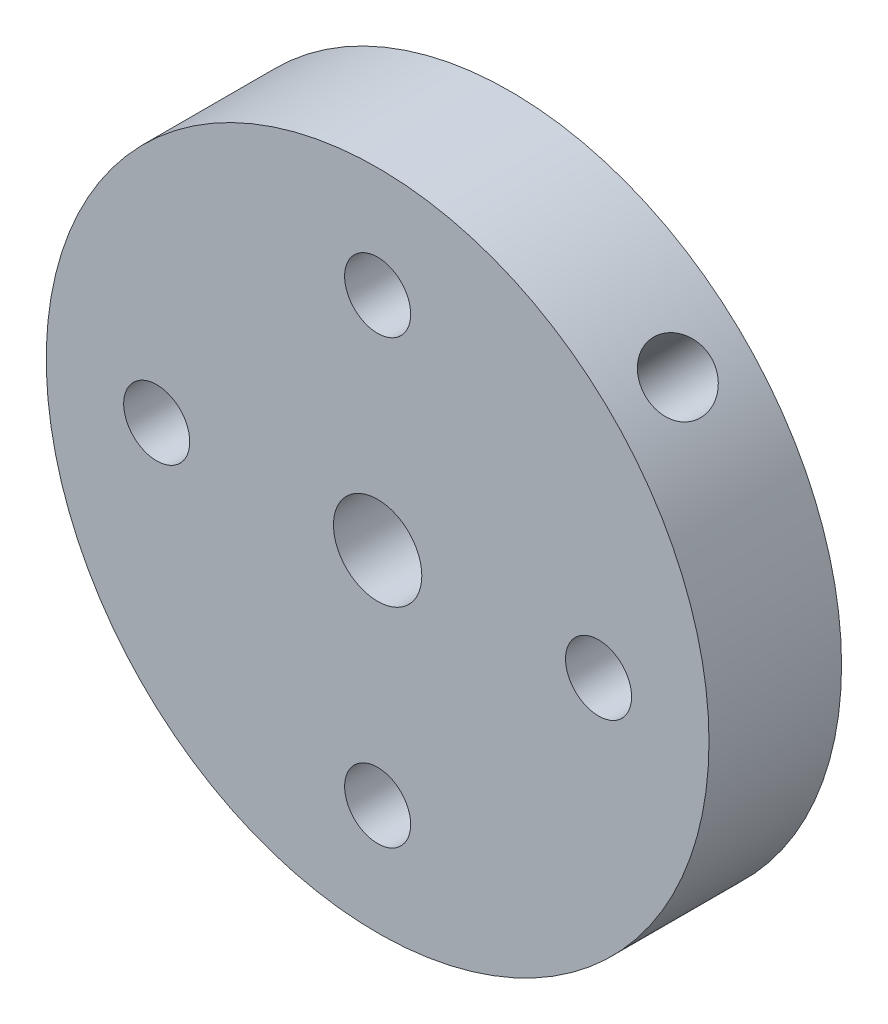
ISO-10303-21;
HEADER;
FILE_DESCRIPTION(('STEP AP214'),'2;1');
FILE_NAME('part.step','',(''),(''),'','','');
FILE_SCHEMA(('AUTOMOTIVE_DESIGN { 1 0 10303 214 1 1 1 1 }'));
ENDSEC;
DATA;
#1=APPLICATION_CONTEXT('core data for automotive mechanical design processes');
#2=APPLICATION_PROTOCOL_DEFINITION('international standard','automotive_design',2000,#1);
#3=PRODUCT_CONTEXT('',#1,'mechanical');
#4=PRODUCT('Part','Part','',(#3));
#5=PRODUCT_RELATED_PRODUCT_CATEGORY('part','',(#4));
#6=PRODUCT_DEFINITION_FORMATION('','',#4);
#7=PRODUCT_DEFINITION_CONTEXT('part definition',#1,'design');
#8=PRODUCT_DEFINITION('design','',#6,#7);
#9=PRODUCT_DEFINITION_SHAPE('','',#8);
#10=(LENGTH_UNIT() NAMED_UNIT(*) SI_UNIT(.MILLI.,.METRE.));
#11=(NAMED_UNIT(*) PLANE_ANGLE_UNIT() SI_UNIT($,.RADIAN.));
#12=(NAMED_UNIT(*) SI_UNIT($,.STERADIAN.) SOLID_ANGLE_UNIT());
#13=UNCERTAINTY_MEASURE_WITH_UNIT(LENGTH_MEASURE(1.E-05),#10,'distance_accuracy_value','');
#14=(GEOMETRIC_REPRESENTATION_CONTEXT(3) GLOBAL_UNCERTAINTY_ASSIGNED_CONTEXT((#13)) GLOBAL_UNIT_ASSIGNED_CONTEXT((#10,
#11,#12)) REPRESENTATION_CONTEXT('',''));
#15=CARTESIAN_POINT('',(0.,0.,0.));
#16=DIRECTION('',(0.,0.,1.));
#17=DIRECTION('',(1.,0.,0.));
#18=AXIS2_PLACEMENT_3D('',#15,#16,#17);
#19=CARTESIAN_POINT('',(0.,0.,7.62));
#20=DIRECTION('',(0.,0.,-1.));
#21=DIRECTION('',(-1.,0.,0.));
#22=AXIS2_PLACEMENT_3D('',#19,#20,#21);
#23=CYLINDRICAL_SURFACE('',#22,19.05);
#24=CARTESIAN_POINT('',(12.0607652587488,14.7458618389485,3.81));
#25=CARTESIAN_POINT('',(12.0607693964712,14.7458594596029,3.70363654533306));
#26=CARTESIAN_POINT('',(12.0677463971615,14.7401604332795,3.59720271784967));
#27=CARTESIAN_POINT('',(12.0954208464211,14.7174591046592,3.38728584945222));
#28=CARTESIAN_POINT('',(12.1161334247608,14.700444337989,3.28380619381438));
#29=CARTESIAN_POINT('',(12.1705129012151,14.6554547326528,3.08286798869541));
#30=CARTESIAN_POINT('',(12.2041719568233,14.6274865289952,2.98540583542883));
#31=CARTESIAN_POINT('',(12.2832344731625,14.5611572616852,2.7992002208209));
#32=CARTESIAN_POINT('',(12.3286355974126,14.5227982655596,2.71045502978768));
#33=CARTESIAN_POINT('',(12.4297735446739,14.4363311535922,2.54386071842834));
#34=CARTESIAN_POINT('',(12.4855431040743,14.3881921131513,2.46604751931031));
#35=CARTESIAN_POINT('',(12.6054370264389,14.2832695883135,2.32383531878836));
#36=CARTESIAN_POINT('',(12.6695617710731,14.226485708995,2.25943693053076));
#37=CARTESIAN_POINT('',(12.8042008246731,14.1054294962761,2.14575838376018));
#38=CARTESIAN_POINT('',(12.874728163514,14.0411418124125,2.0965099925262));
#39=CARTESIAN_POINT('',(13.019799048956,13.9067285974321,2.01473265665415));
#40=CARTESIAN_POINT('',(13.0943424982141,13.8366032077878,1.98220330697914));
#41=CARTESIAN_POINT('',(13.2448805470601,13.6925691286633,1.93489272988213));
#42=CARTESIAN_POINT('',(13.320869463114,13.6186738688526,1.92005254061414));
#43=CARTESIAN_POINT('',(13.4722807301774,13.4689082070713,1.90835910840782));
#44=CARTESIAN_POINT('',(13.5477030957365,13.3930378560473,1.91150540197214));
#45=CARTESIAN_POINT('',(13.6955793263255,13.2417807651437,1.93564775103162));
#46=CARTESIAN_POINT('',(13.7680427785051,13.1663932645888,1.95658040401786));
#47=CARTESIAN_POINT('',(13.9083578630695,13.0180839600682,2.01560250228929));
#48=CARTESIAN_POINT('',(13.9762094358769,12.9451621879616,2.05369216916521));
#49=CARTESIAN_POINT('',(14.1057215217991,12.8039184510238,2.14601661215708));
#50=CARTESIAN_POINT('',(14.1673710222023,12.7356047369459,2.20027945223737));
#51=CARTESIAN_POINT('',(14.2829031743039,12.6059007066775,2.32338953984534));
#52=CARTESIAN_POINT('',(14.3367855996606,12.5445105922601,2.39223721224785));
#53=CARTESIAN_POINT('',(14.4358121074451,12.4304292756698,2.54291922278692));
#54=CARTESIAN_POINT('',(14.4809171857119,12.3777770481222,2.6248087135237));
#55=CARTESIAN_POINT('',(14.5611412671936,12.283302425989,2.7990585756227));
#56=CARTESIAN_POINT('',(14.5962602560807,12.2414800469419,2.89141896200805));
#57=CARTESIAN_POINT('',(14.6557990741542,12.1701365514138,3.084031139083));
#58=CARTESIAN_POINT('',(14.6802166701441,12.1406180025933,3.18428457177138));
#59=CARTESIAN_POINT('',(14.7178485688728,12.0949707094796,3.38981612885819));
#60=CARTESIAN_POINT('',(14.7310632106088,12.0788415600287,3.4950941011142));
#61=CARTESIAN_POINT('',(14.7459932855233,12.0606103870114,3.70720225077733));
#62=CARTESIAN_POINT('',(14.7477578597418,12.0584484197072,3.81402382032354));
#63=CARTESIAN_POINT('',(14.7398835434853,12.0680723509271,4.02661178740976));
#64=CARTESIAN_POINT('',(14.73024480605,12.0798580622645,4.13237819909147));
#65=CARTESIAN_POINT('',(14.6997877057915,12.1169017700428,4.33962876558752));
#66=CARTESIAN_POINT('',(14.6789927273769,12.1421315857791,4.44112140040984));
#67=CARTESIAN_POINT('',(14.626650904889,12.205132147804,4.63720698517376));
#68=CARTESIAN_POINT('',(14.5951038161171,12.2429031795075,4.73179977802792));
#69=CARTESIAN_POINT('',(14.5217673829784,12.3298014239678,4.91175214737434));
#70=CARTESIAN_POINT('',(14.479943740446,12.3789666331017,4.99707939579862));
#71=CARTESIAN_POINT('',(14.3869777722955,12.4868903274889,5.15575074354866));
#72=CARTESIAN_POINT('',(14.3358352174842,12.5456490486856,5.22909454806426));
#73=CARTESIAN_POINT('',(14.2251418955943,12.6710237361858,5.36198298567643));
#74=CARTESIAN_POINT('',(14.1655616973649,12.7376670646792,5.421477304071));
#75=CARTESIAN_POINT('',(14.03951191643,12.8764661910945,5.5246317321154));
#76=CARTESIAN_POINT('',(13.9730424275927,12.9486219139053,5.56829205747039));
#77=CARTESIAN_POINT('',(13.8349808416468,13.0960290133026,5.63845386590672));
#78=CARTESIAN_POINT('',(13.7633980737617,13.1712746507702,5.66498575459556));
#79=CARTESIAN_POINT('',(13.6168928793156,13.3226806471027,5.70023678127548));
#80=CARTESIAN_POINT('',(13.5419705460048,13.3988409803833,5.70895641631765));
#81=CARTESIAN_POINT('',(13.3912102910109,13.5495127764759,5.70832845468449));
#82=CARTESIAN_POINT('',(13.3153777427226,13.6240299536206,5.69905897377231));
#83=CARTESIAN_POINT('',(13.1646899148193,13.7696922624728,5.66287969005155));
#84=CARTESIAN_POINT('',(13.0898346359852,13.8408373914853,5.63596987314502));
#85=CARTESIAN_POINT('',(12.9433817478405,13.9778909171686,5.56529538835375));
#86=CARTESIAN_POINT('',(12.8717837021329,14.0438000162396,5.52153298582166));
#87=CARTESIAN_POINT('',(12.7340764193687,14.1687845417768,5.41840393316273));
#88=CARTESIAN_POINT('',(12.6679671490208,14.2278600096921,5.35903737768935));
#89=CARTESIAN_POINT('',(12.5431068868556,14.3380593030475,5.22609231134029));
#90=CARTESIAN_POINT('',(12.4843876838234,14.3891489907141,5.15245564663382));
#91=CARTESIAN_POINT('',(12.3765845125446,14.4819795196042,4.99317505850507));
#92=CARTESIAN_POINT('',(12.3275028603909,14.5237181139152,4.90752825726714));
#93=CARTESIAN_POINT('',(12.2405791210252,14.5970536449,4.72642191089201));
#94=CARTESIAN_POINT('',(12.2027657655561,14.6286246727086,4.63093810285303));
#95=CARTESIAN_POINT('',(12.1399340276247,14.6808101024207,4.43310453562891));
#96=CARTESIAN_POINT('',(12.1149012077113,14.7014368684789,4.33076267216833));
#97=CARTESIAN_POINT('',(12.0847794975603,14.7261953020554,4.1582006974992));
#98=CARTESIAN_POINT('',(12.0757891975141,14.7335629195371,4.08908394094751));
#99=CARTESIAN_POINT('',(12.0637807287949,14.7433969608363,3.94998828328961));
#100=CARTESIAN_POINT('',(12.0607625352626,14.7458634050553,3.88000938577336));
#101=CARTESIAN_POINT('',(12.0607652587488,14.7458618389485,3.81));
#102=B_SPLINE_CURVE_WITH_KNOTS('',3,(#24,#25,#26,#27,#28,#29,#30,#31,#32,#33,#34,#35,#36,#37,
#38,#39,#40,#41,#42,#43,#44,#45,#46,#47,#48,#49,#50,#51,#52,#53,#54,#55,#56,#57,#58,#59,#60,#61,
#62,#63,#64,#65,#66,#67,#68,#69,#70,#71,#72,#73,#74,#75,#76,#77,#78,#79,#80,#81,#82,#83,#84,#85,
#86,#87,#88,#89,#90,#91,#92,#93,#94,#95,#96,#97,#98,#99,#100,#101),.UNSPECIFIED.,.T.,.F.,(4,2,2,
2,2,2,2,2,2,2,2,2,2,2,2,2,2,2,2,2,2,2,2,2,2,2,2,2,2,2,2,2,2,2,2,2,2,2,4),(0.,0.318834702826371,
0.638021187449687,0.957014624213589,1.27594463524174,1.59589925668023,1.9158684989716,
2.23650416626076,2.55713206543638,2.87668822607536,3.19623615204334,3.51464975076521,
3.83306746206332,4.15204094615402,4.47102372362852,4.79139313309118,5.11176300220994,
5.43219969521278,5.75262669158095,6.07167757473279,6.39072417606591,6.70910462719294,
7.02749232456847,7.34695743425781,7.66643040207063,7.98704649575267,8.30765822154457,
8.62769923580696,8.94773131919996,9.26637680748654,9.58502255043136,9.90362547542723,
10.2222264678493,10.5421542216201,10.8621587664702,11.1829724068385,11.5034228357657,
11.7132835881566,11.9231434669843),.UNSPECIFIED.);
#103=CARTESIAN_POINT('',(12.0607652587488,14.7458618389485,3.81));
#104=VERTEX_POINT('',#103);
#105=EDGE_CURVE('E10',#104,#104,#102,.T.);
#106=ORIENTED_EDGE('',*,*,#105,.T.);
#107=EDGE_LOOP('',(#106));
#108=FACE_BOUND('',#107,.T.);
#109=CARTESIAN_POINT('',(0.,0.,7.62));
#110=DIRECTION('',(0.,0.,1.));
#111=DIRECTION('',(1.,0.,0.));
#112=AXIS2_PLACEMENT_3D('',#109,#110,#111);
#113=CIRCLE('',#112,19.05);
#114=CARTESIAN_POINT('',(19.05,0.,7.62));
#115=VERTEX_POINT('',#114);
#116=EDGE_CURVE('E45',#115,#115,#113,.T.);
#117=ORIENTED_EDGE('',*,*,#116,.F.);
#118=EDGE_LOOP('',(#117));
#119=FACE_BOUND('',#118,.T.);
#120=CARTESIAN_POINT('',(0.,0.,0.));
#121=DIRECTION('',(0.,0.,1.));
#122=DIRECTION('',(1.,0.,0.));
#123=AXIS2_PLACEMENT_3D('',#120,#121,#122);
#124=CIRCLE('',#123,19.05);
#125=CARTESIAN_POINT('',(19.05,0.,0.));
#126=VERTEX_POINT('',#125);
#127=EDGE_CURVE('E49',#126,#126,#124,.T.);
#128=ORIENTED_EDGE('',*,*,#127,.T.);
#129=EDGE_LOOP('',(#128));
#130=FACE_BOUND('',#129,.T.);
#131=ADVANCED_FACE('F35',(#108,#119,#130),#23,.T.);
#132=CARTESIAN_POINT('',(0.,0.,7.62));
#133=DIRECTION('',(0.,0.,1.));
#134=DIRECTION('',(1.,0.,0.));
#135=AXIS2_PLACEMENT_3D('',#132,#133,#134);
#136=PLANE('',#135);
#137=CARTESIAN_POINT('',(12.7,1.33025439009923E-13,7.62));
#138=DIRECTION('',(0.,0.,1.));
#139=DIRECTION('',(1.,0.,0.));
#140=AXIS2_PLACEMENT_3D('',#137,#138,#139);
#141=CIRCLE('',#140,1.89864999999999);
#142=CARTESIAN_POINT('',(14.59865,1.33025439009923E-13,7.62));
#143=VERTEX_POINT('',#142);
#144=EDGE_CURVE('E82',#143,#143,#141,.T.);
#145=ORIENTED_EDGE('',*,*,#144,.F.);
#146=EDGE_LOOP('',(#145));
#147=FACE_BOUND('',#146,.T.);
#148=CARTESIAN_POINT('',(0.,-12.7,7.62));
#149=DIRECTION('',(0.,0.,1.));
#150=DIRECTION('',(1.,0.,0.));
#151=AXIS2_PLACEMENT_3D('',#148,#149,#150);
#152=CIRCLE('',#151,1.89864999999999);
#153=CARTESIAN_POINT('',(1.89864999999999,-12.7,7.62));
#154=VERTEX_POINT('',#153);
#155=EDGE_CURVE('E76',#154,#154,#152,.T.);
#156=ORIENTED_EDGE('',*,*,#155,.F.);
#157=EDGE_LOOP('',(#156));
#158=FACE_BOUND('',#157,.T.);
#159=CARTESIAN_POINT('',(-12.7,0.,7.62));
#160=DIRECTION('',(0.,0.,1.));
#161=DIRECTION('',(1.,0.,0.));
#162=AXIS2_PLACEMENT_3D('',#159,#160,#161);
#163=CIRCLE('',#162,1.89864999999999);
#164=CARTESIAN_POINT('',(-10.80135,0.,7.62));
#165=VERTEX_POINT('',#164);
#166=EDGE_CURVE('E70',#165,#165,#163,.T.);
#167=ORIENTED_EDGE('',*,*,#166,.F.);
#168=EDGE_LOOP('',(#167));
#169=FACE_BOUND('',#168,.T.);
#170=CARTESIAN_POINT('',(0.,12.7,7.62));
#171=DIRECTION('',(0.,0.,1.));
#172=DIRECTION('',(1.,0.,0.));
#173=AXIS2_PLACEMENT_3D('',#170,#171,#172);
#174=CIRCLE('',#173,1.89864999999999);
#175=CARTESIAN_POINT('',(1.89864999999999,12.7,7.62));
#176=VERTEX_POINT('',#175);
#177=EDGE_CURVE('E64',#176,#176,#174,.T.);
#178=ORIENTED_EDGE('',*,*,#177,.F.);
#179=EDGE_LOOP('',(#178));
#180=FACE_BOUND('',#179,.T.);
#181=CARTESIAN_POINT('',(0.,0.,7.62));
#182=DIRECTION('',(0.,0.,1.));
#183=DIRECTION('',(1.,0.,0.));
#184=AXIS2_PLACEMENT_3D('',#181,#182,#183);
#185=CIRCLE('',#184,2.54);
#186=CARTESIAN_POINT('',(2.54,0.,7.62));
#187=VERTEX_POINT('',#186);
#188=EDGE_CURVE('E56',#187,#187,#185,.T.);
#189=ORIENTED_EDGE('',*,*,#188,.F.);
#190=EDGE_LOOP('',(#189));
#191=FACE_BOUND('',#190,.T.);
#192=ORIENTED_EDGE('',*,*,#116,.T.);
#193=EDGE_LOOP('',(#192));
#194=FACE_BOUND('',#193,.T.);
#195=ADVANCED_FACE('F123',(#147,#158,#169,#180,#191,#194),#136,.T.);
#196=CARTESIAN_POINT('',(0.,0.,0.));
#197=DIRECTION('',(0.,0.,1.));
#198=DIRECTION('',(1.,0.,0.));
#199=AXIS2_PLACEMENT_3D('',#196,#197,#198);
#200=PLANE('',#199);
#201=CARTESIAN_POINT('',(12.7,1.33025439009923E-13,0.));
#202=DIRECTION('',(0.,0.,1.));
#203=DIRECTION('',(1.,0.,0.));
#204=AXIS2_PLACEMENT_3D('',#201,#202,#203);
#205=CIRCLE('',#204,1.89865);
#206=CARTESIAN_POINT('',(14.59865,1.33025439009923E-13,0.));
#207=VERTEX_POINT('',#206);
#208=EDGE_CURVE('E79',#207,#207,#205,.T.);
#209=ORIENTED_EDGE('',*,*,#208,.T.);
#210=EDGE_LOOP('',(#209));
#211=FACE_BOUND('',#210,.T.);
#212=CARTESIAN_POINT('',(0.,-12.7,0.));
#213=DIRECTION('',(0.,0.,1.));
#214=DIRECTION('',(1.,0.,0.));
#215=AXIS2_PLACEMENT_3D('',#212,#213,#214);
#216=CIRCLE('',#215,1.89865);
#217=CARTESIAN_POINT('',(1.89865,-12.7,0.));
#218=VERTEX_POINT('',#217);
#219=EDGE_CURVE('E73',#218,#218,#216,.T.);
#220=ORIENTED_EDGE('',*,*,#219,.T.);
#221=EDGE_LOOP('',(#220));
#222=FACE_BOUND('',#221,.T.);
#223=CARTESIAN_POINT('',(-12.7,0.,0.));
#224=DIRECTION('',(0.,0.,1.));
#225=DIRECTION('',(1.,0.,0.));
#226=AXIS2_PLACEMENT_3D('',#223,#224,#225);
#227=CIRCLE('',#226,1.89865);
#228=CARTESIAN_POINT('',(-10.80135,0.,0.));
#229=VERTEX_POINT('',#228);
#230=EDGE_CURVE('E67',#229,#229,#227,.T.);
#231=ORIENTED_EDGE('',*,*,#230,.T.);
#232=EDGE_LOOP('',(#231));
#233=FACE_BOUND('',#232,.T.);
#234=CARTESIAN_POINT('',(0.,12.7,0.));
#235=DIRECTION('',(0.,0.,1.));
#236=DIRECTION('',(1.,0.,0.));
#237=AXIS2_PLACEMENT_3D('',#234,#235,#236);
#238=CIRCLE('',#237,1.89865);
#239=CARTESIAN_POINT('',(1.89865,12.7,0.));
#240=VERTEX_POINT('',#239);
#241=EDGE_CURVE('E59',#240,#240,#238,.T.);
#242=ORIENTED_EDGE('',*,*,#241,.T.);
#243=EDGE_LOOP('',(#242));
#244=FACE_BOUND('',#243,.T.);
#245=CARTESIAN_POINT('',(0.,0.,0.));
#246=DIRECTION('',(0.,0.,1.));
#247=DIRECTION('',(1.,0.,0.));
#248=AXIS2_PLACEMENT_3D('',#245,#246,#247);
#249=CIRCLE('',#248,2.54);
#250=CARTESIAN_POINT('',(2.54,0.,0.));
#251=VERTEX_POINT('',#250);
#252=EDGE_CURVE('E54',#251,#251,#249,.T.);
#253=ORIENTED_EDGE('',*,*,#252,.T.);
#254=EDGE_LOOP('',(#253));
#255=FACE_BOUND('',#254,.T.);
#256=ORIENTED_EDGE('',*,*,#127,.F.);
#257=EDGE_LOOP('',(#256));
#258=FACE_BOUND('',#257,.T.);
#259=ADVANCED_FACE('F118',(#211,#222,#233,#244,#255,#258),#200,.F.);
#260=CARTESIAN_POINT('',(0.,0.,0.));
#261=DIRECTION('',(0.,0.,1.));
#262=DIRECTION('',(1.,0.,0.));
#263=AXIS2_PLACEMENT_3D('',#260,#261,#262);
#264=CYLINDRICAL_SURFACE('',#263,2.54);
#265=CARTESIAN_POINT('',(2.54,0.,3.1943119113545));
#266=CARTESIAN_POINT('',(2.5399946984759,0.052385191048335,3.08624034198922));
#267=CARTESIAN_POINT('',(2.5383481888273,0.115920045304494,2.98353318246277));
#268=CARTESIAN_POINT('',(2.52785193029602,0.258267972938143,2.78930705808274));
#269=CARTESIAN_POINT('',(2.51896541567282,0.337157459357075,2.69784794711324));
#270=CARTESIAN_POINT('',(2.49074491497768,0.504984120629924,2.52732990227837));
#271=CARTESIAN_POINT('',(2.47146134928101,0.593871179444067,2.44821348065233));
#272=CARTESIAN_POINT('',(2.41972178472364,0.778254060168674,2.30340662051189));
#273=CARTESIAN_POINT('',(2.38730023346925,0.873732061697931,2.2376817416883));
#274=CARTESIAN_POINT('',(2.31475835807238,1.04914249995492,2.13300662278501));
#275=CARTESIAN_POINT('',(2.27730294185327,1.1285488240575,2.09133918987004));
#276=CARTESIAN_POINT('',(2.19165069853286,1.28699529238559,2.01992286487085));
#277=CARTESIAN_POINT('',(2.14345887708577,1.36603558979105,1.99016843658867));
#278=CARTESIAN_POINT('',(2.03613413251818,1.52142047129189,1.94409166509938));
#279=CARTESIAN_POINT('',(1.97693241400329,1.59774429683894,1.92785750492933));
#280=CARTESIAN_POINT('',(1.84917514590721,1.74400688492436,1.91031928967198));
#281=CARTESIAN_POINT('',(1.78062467881446,1.81394908261436,1.90900715464604));
#282=CARTESIAN_POINT('',(1.64448571953493,1.93773376877341,1.9207066822378));
#283=CARTESIAN_POINT('',(1.57759418807191,1.99249931123271,1.93218538060448));
#284=CARTESIAN_POINT('',(1.44052008343058,2.09374422597958,1.96638515924222));
#285=CARTESIAN_POINT('',(1.3703368979559,2.14022204884564,1.98910833872145));
#286=CARTESIAN_POINT('',(1.22702002535716,2.22557018741725,2.04539160730454));
#287=CARTESIAN_POINT('',(1.15385683296319,2.26421479175018,2.07921471305748));
#288=CARTESIAN_POINT('',(1.00835356480194,2.33265873261454,2.15615901170264));
#289=CARTESIAN_POINT('',(0.9360136171508,2.36245671002741,2.19928163153604));
#290=CARTESIAN_POINT('',(0.782307409872193,2.41812076422424,2.30126932899305));
#291=CARTESIAN_POINT('',(0.701372815608911,2.44257215927433,2.36155240903919));
#292=CARTESIAN_POINT('',(0.545011953114874,2.48215372874686,2.49179064534749));
#293=CARTESIAN_POINT('',(0.469597268992068,2.49726476949393,2.56176529840825));
#294=CARTESIAN_POINT('',(0.313009016485387,2.52210890381363,2.72484060560579));
#295=CARTESIAN_POINT('',(0.233508537536363,2.53025300067866,2.81980211462517));
#296=CARTESIAN_POINT('',(0.0912252218023628,2.53935724823942,3.02183878347659));
#297=CARTESIAN_POINT('',(0.0284017307918163,2.54033502650334,3.12888356140594));
#298=CARTESIAN_POINT('',(-0.0535387905519082,2.53963545936342,3.31196713698076));
#299=CARTESIAN_POINT('',(-0.0802129730244642,2.53881527073061,3.38460598277554));
#300=CARTESIAN_POINT('',(-0.121364940100028,2.53718377486282,3.53319881030552));
#301=CARTESIAN_POINT('',(-0.135870574922423,2.53637245156501,3.60914480121919));
#302=CARTESIAN_POINT('',(-0.150969524303518,2.53552294287844,3.76293517347629));
#303=CARTESIAN_POINT('',(-0.151476908030819,2.53548953304933,3.84078834522087));
#304=CARTESIAN_POINT('',(-0.138284249212618,2.53623980244509,3.9953069351053));
#305=CARTESIAN_POINT('',(-0.124568671584598,2.53702437511944,4.0719709614728));
#306=CARTESIAN_POINT('',(-0.0811397917499116,2.53880978780697,4.23529065955116));
#307=CARTESIAN_POINT('',(-0.0490094840908746,2.53982424235148,4.32128962163811));
#308=CARTESIAN_POINT('',(0.0285373160944719,2.54013450277937,4.48710833986116));
#309=CARTESIAN_POINT('',(0.0739869389819441,2.53942599050419,4.56691205221488));
#310=CARTESIAN_POINT('',(0.192734367035198,2.533598151421,4.74723840504763));
#311=CARTESIAN_POINT('',(0.270179957490561,2.52699318885995,4.8449749587208));
#312=CARTESIAN_POINT('',(0.437367709247392,2.50349151575023,5.02793315721021));
#313=CARTESIAN_POINT('',(0.527122693809509,2.48658400848171,5.11314155650566));
#314=CARTESIAN_POINT('',(0.715867910875416,2.43899978674669,5.27068593313211));
#315=CARTESIAN_POINT('',(0.814949398076502,2.40817268301342,5.34286893115121));
#316=CARTESIAN_POINT('',(1.01720063309982,2.32993101159249,5.47043724592829));
#317=CARTESIAN_POINT('',(1.12035875897372,2.28256095201716,5.52586689773375));
#318=CARTESIAN_POINT('',(1.29674693074771,2.18566825756024,5.60370452636215));
#319=CARTESIAN_POINT('',(1.37022211946824,2.14051053294325,5.63101606301104));
#320=CARTESIAN_POINT('',(1.51437853016063,2.04105366328482,5.67387607903323));
#321=CARTESIAN_POINT('',(1.58506179354345,1.98676135601953,5.68943330972253));
#322=CARTESIAN_POINT('',(1.72143260639127,1.8698556662811,5.707889805348));
#323=CARTESIAN_POINT('',(1.78710301870875,1.8072155882504,5.71074740636583));
#324=CARTESIAN_POINT('',(1.91101275259411,1.67564813895483,5.70350094724767));
#325=CARTESIAN_POINT('',(1.9692512937101,1.60672010866704,5.69339552704014));
#326=CARTESIAN_POINT('',(2.07421667994737,1.46846837568125,5.66167109643418));
#327=CARTESIAN_POINT('',(2.12136600584065,1.39932739981847,5.64063673257551));
#328=CARTESIAN_POINT('',(2.2071780194348,1.25963981032951,5.58848281688746));
#329=CARTESIAN_POINT('',(2.24583881248637,1.18909288671928,5.55736101736267));
#330=CARTESIAN_POINT('',(2.31807053372201,1.04186778710893,5.4829054186505));
#331=CARTESIAN_POINT('',(2.35082628260958,0.965233820409557,5.43870120087132));
#332=CARTESIAN_POINT('',(2.40720956501212,0.814511916690892,5.34110596322138));
#333=CARTESIAN_POINT('',(2.43083069757239,0.740425798041368,5.28770853906965));
#334=CARTESIAN_POINT('',(2.47384484964003,0.582736951291972,5.16180532130742));
#335=CARTESIAN_POINT('',(2.49155808295845,0.500034187557079,5.08759887365742));
#336=CARTESIAN_POINT('',(2.51790326856836,0.343587147938483,4.92872660288486));
#337=CARTESIAN_POINT('',(2.52652776436589,0.269850271560998,4.84405225531612));
#338=CARTESIAN_POINT('',(2.53653392270082,0.144755881870138,4.67742985537028));
#339=CARTESIAN_POINT('',(2.53877138848752,0.091706966439904,4.59680750057937));
#340=CARTESIAN_POINT('',(2.54042703910193,-0.00146662909992836,4.4284099312379));
#341=CARTESIAN_POINT('',(2.53985170724482,-0.0416208030975835,4.3406516236994));
#342=CARTESIAN_POINT('',(2.53824678817292,-0.097518795497361,4.17942762295494));
#343=CARTESIAN_POINT('',(2.53734815664361,-0.116718765644181,4.10717552047142));
#344=CARTESIAN_POINT('',(2.53602593523687,-0.142656062692624,3.9604647437622));
#345=CARTESIAN_POINT('',(2.53560180591434,-0.149407547518496,3.88600867424227));
#346=CARTESIAN_POINT('',(2.53559134216696,-0.14959087857327,3.73691596281528));
#347=CARTESIAN_POINT('',(2.53600690189772,-0.142992610624441,3.66227929284159));
#348=CARTESIAN_POINT('',(2.53732071855286,-0.117289637855629,3.51523886743248));
#349=CARTESIAN_POINT('',(2.53821910665184,-0.0981815340606971,3.44283572445573));
#350=CARTESIAN_POINT('',(2.53953551921028,-0.0528820392689401,3.31153458058613));
#351=CARTESIAN_POINT('',(2.54000283752587,-0.028038038077537,3.25215487644299));
#352=CARTESIAN_POINT('',(2.54,0.,3.1943119113545));
#353=B_SPLINE_CURVE_WITH_KNOTS('',3,(#265,#266,#267,#268,#269,#270,#271,#272,#273,#274,#275,
#276,#277,#278,#279,#280,#281,#282,#283,#284,#285,#286,#287,#288,#289,#290,#291,#292,#293,#294,
#295,#296,#297,#298,#299,#300,#301,#302,#303,#304,#305,#306,#307,#308,#309,#310,#311,#312,#313,
#314,#315,#316,#317,#318,#319,#320,#321,#322,#323,#324,#325,#326,#327,#328,#329,#330,#331,#332,
#333,#334,#335,#336,#337,#338,#339,#340,#341,#342,#343,#344,#345,#346,#347,#348,#349,#350,#351,
#352),.UNSPECIFIED.,.T.,.F.,(4,2,2,2,2,2,2,2,2,2,2,2,2,2,2,2,2,2,2,2,2,2,2,2,2,2,2,2,2,2,2,2,2,
2,2,2,2,2,2,2,2,2,2,4),(0.,0.360039952521441,0.721919718311447,1.08206013293459,
1.44126231233854,1.73164832083818,2.02189922441041,2.31402872142607,2.60600002939921,
2.8664114261687,3.12687145693701,3.39401228771698,3.66119413847065,3.9715747449469,
4.28258907569067,4.65330083877384,5.02310042542575,5.25442033632331,5.48520936841115,
5.71741482812617,5.94987418253358,6.22379446876812,6.4984019706248,6.87113395790799,
7.24425722915013,7.62151197981461,7.99775946434303,8.26802476508819,8.53808864908901,
8.80903788588613,9.08001555282165,9.3377973061135,9.59563653820029,9.87761082513094,
10.1597823451039,10.4960717685683,10.8326368730668,11.1213236637824,11.4093453644015,
11.6327148884045,11.8558302124745,12.0794493979789,12.3031293669848,12.4958329478292),.UNSPECIFIED.);
#354=CARTESIAN_POINT('',(2.54,0.,3.1943119113545));
#355=VERTEX_POINT('',#354);
#356=EDGE_CURVE('E85',#355,#355,#353,.T.);
#357=ORIENTED_EDGE('',*,*,#356,.T.);
#358=EDGE_LOOP('',(#357));
#359=FACE_BOUND('',#358,.T.);
#360=ORIENTED_EDGE('',*,*,#252,.F.);
#361=EDGE_LOOP('',(#360));
#362=FACE_BOUND('',#361,.T.);
#363=ORIENTED_EDGE('',*,*,#188,.T.);
#364=EDGE_LOOP('',(#363));
#365=FACE_BOUND('',#364,.T.);
#366=ADVANCED_FACE('F90',(#359,#362,#365),#264,.F.);
#367=CARTESIAN_POINT('',(0.,12.7,7.62));
#368=DIRECTION('',(0.,0.,1.));
#369=DIRECTION('',(1.,0.,0.));
#370=AXIS2_PLACEMENT_3D('',#367,#368,#369);
#371=CYLINDRICAL_SURFACE('',#370,1.89864999999999);
#372=ORIENTED_EDGE('',*,*,#241,.F.);
#373=EDGE_LOOP('',(#372));
#374=FACE_BOUND('',#373,.T.);
#375=ORIENTED_EDGE('',*,*,#177,.T.);
#376=EDGE_LOOP('',(#375));
#377=FACE_BOUND('',#376,.T.);
#378=ADVANCED_FACE('F110',(#374,#377),#371,.F.);
#379=CARTESIAN_POINT('',(-12.7,0.,7.62));
#380=DIRECTION('',(0.,0.,1.));
#381=DIRECTION('',(1.,0.,0.));
#382=AXIS2_PLACEMENT_3D('',#379,#380,#381);
#383=CYLINDRICAL_SURFACE('',#382,1.89864999999999);
#384=ORIENTED_EDGE('',*,*,#230,.F.);
#385=EDGE_LOOP('',(#384));
#386=FACE_BOUND('',#385,.T.);
#387=ORIENTED_EDGE('',*,*,#166,.T.);
#388=EDGE_LOOP('',(#387));
#389=FACE_BOUND('',#388,.T.);
#390=ADVANCED_FACE('F107',(#386,#389),#383,.F.);
#391=CARTESIAN_POINT('',(0.,-12.7,7.62));
#392=DIRECTION('',(0.,0.,1.));
#393=DIRECTION('',(1.,0.,0.));
#394=AXIS2_PLACEMENT_3D('',#391,#392,#393);
#395=CYLINDRICAL_SURFACE('',#394,1.89864999999999);
#396=ORIENTED_EDGE('',*,*,#219,.F.);
#397=EDGE_LOOP('',(#396));
#398=FACE_BOUND('',#397,.T.);
#399=ORIENTED_EDGE('',*,*,#155,.T.);
#400=EDGE_LOOP('',(#399));
#401=FACE_BOUND('',#400,.T.);
#402=ADVANCED_FACE('F103',(#398,#401),#395,.F.);
#403=CARTESIAN_POINT('',(12.7,1.33025439009923E-13,7.62));
#404=DIRECTION('',(0.,0.,1.));
#405=DIRECTION('',(1.,0.,0.));
#406=AXIS2_PLACEMENT_3D('',#403,#404,#405);
#407=CYLINDRICAL_SURFACE('',#406,1.89864999999999);
#408=ORIENTED_EDGE('',*,*,#208,.F.);
#409=EDGE_LOOP('',(#408));
#410=FACE_BOUND('',#409,.T.);
#411=ORIENTED_EDGE('',*,*,#144,.T.);
#412=EDGE_LOOP('',(#411));
#413=FACE_BOUND('',#412,.T.);
#414=ADVANCED_FACE('F98',(#410,#413),#407,.F.);
#415=CARTESIAN_POINT('',(13.4703841816037,13.4703841816037,3.81));
#416=DIRECTION('',(0.707106781186546,0.707106781186549,0.));
#417=DIRECTION('',(-0.707106781186549,0.707106781186546,0.));
#418=AXIS2_PLACEMENT_3D('',#415,#416,#417);
#419=CYLINDRICAL_SURFACE('',#418,1.89864999999999);
#420=ORIENTED_EDGE('',*,*,#105,.F.);
#421=EDGE_LOOP('',(#420));
#422=FACE_BOUND('',#421,.T.);
#423=ORIENTED_EDGE('',*,*,#356,.F.);
#424=EDGE_LOOP('',(#423));
#425=FACE_BOUND('',#424,.T.);
#426=ADVANCED_FACE('F94',(#422,#425),#419,.F.);
#427=CLOSED_SHELL('',(#131,#195,#259,#366,#378,#390,#402,#414,#426));
#428=MANIFOLD_SOLID_BREP('B2',#427);
#429=ADVANCED_BREP_SHAPE_REPRESENTATION('',(#18,#428),#14);
#430=SHAPE_DEFINITION_REPRESENTATION(#9,#429);
ENDSEC;
END-ISO-10303-21;
